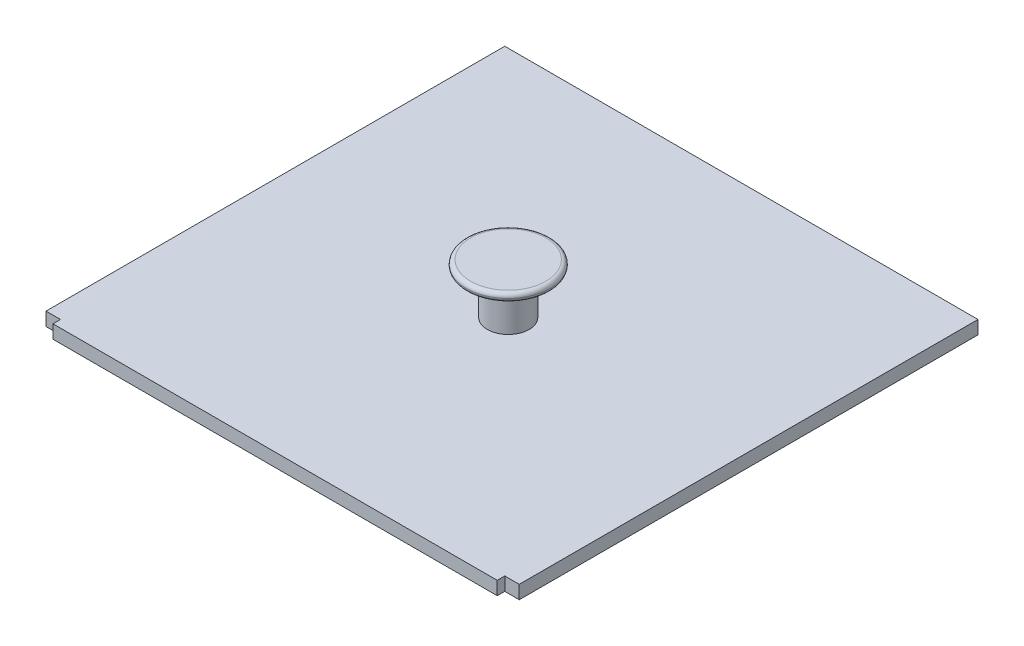
ISO-10303-21;
HEADER;
FILE_DESCRIPTION(('STEP AP214'),'2;1');
FILE_NAME('part.step','',(''),(''),'','','');
FILE_SCHEMA(('AUTOMOTIVE_DESIGN { 1 0 10303 214 1 1 1 1 }'));
ENDSEC;
DATA;
#1=APPLICATION_CONTEXT('core data for automotive mechanical design processes');
#2=APPLICATION_PROTOCOL_DEFINITION('international standard','automotive_design',2000,#1);
#3=PRODUCT_CONTEXT('',#1,'mechanical');
#4=PRODUCT('Part','Part','',(#3));
#5=PRODUCT_RELATED_PRODUCT_CATEGORY('part','',(#4));
#6=PRODUCT_DEFINITION_FORMATION('','',#4);
#7=PRODUCT_DEFINITION_CONTEXT('part definition',#1,'design');
#8=PRODUCT_DEFINITION('design','',#6,#7);
#9=PRODUCT_DEFINITION_SHAPE('','',#8);
#10=(LENGTH_UNIT() NAMED_UNIT(*) SI_UNIT(.MILLI.,.METRE.));
#11=(NAMED_UNIT(*) PLANE_ANGLE_UNIT() SI_UNIT($,.RADIAN.));
#12=(NAMED_UNIT(*) SI_UNIT($,.STERADIAN.) SOLID_ANGLE_UNIT());
#13=UNCERTAINTY_MEASURE_WITH_UNIT(LENGTH_MEASURE(1.E-05),#10,'distance_accuracy_value','');
#14=(GEOMETRIC_REPRESENTATION_CONTEXT(3) GLOBAL_UNCERTAINTY_ASSIGNED_CONTEXT((#13)) GLOBAL_UNIT_ASSIGNED_CONTEXT((#10,
#11,#12)) REPRESENTATION_CONTEXT('',''));
#15=CARTESIAN_POINT('',(0.,0.,0.));
#16=DIRECTION('',(0.,0.,1.));
#17=DIRECTION('',(1.,0.,0.));
#18=AXIS2_PLACEMENT_3D('',#15,#16,#17);
#19=CARTESIAN_POINT('',(84.9,2.4,-83.65));
#20=DIRECTION('',(-1.,0.,0.));
#21=DIRECTION('',(0.,0.,1.));
#22=AXIS2_PLACEMENT_3D('',#19,#20,#21);
#23=PLANE('',#22);
#24=DIRECTION('',(0.,0.,-1.));
#25=VECTOR('',#24,1.);
#26=CARTESIAN_POINT('',(84.9,2.4,-83.65));
#27=LINE('',#26,#25);
#28=CARTESIAN_POINT('',(84.9,2.4,80.95));
#29=VERTEX_POINT('',#28);
#30=CARTESIAN_POINT('',(84.9,2.4,-83.65));
#31=VERTEX_POINT('',#30);
#32=EDGE_CURVE('E136',#29,#31,#27,.T.);
#33=ORIENTED_EDGE('',*,*,#32,.F.);
#34=DIRECTION('',(0.,1.,0.));
#35=VECTOR('',#34,1.);
#36=CARTESIAN_POINT('',(84.9,-2.4,80.95));
#37=LINE('',#36,#35);
#38=CARTESIAN_POINT('',(84.9,-2.4,80.95));
#39=VERTEX_POINT('',#38);
#40=EDGE_CURVE('E175',#39,#29,#37,.T.);
#41=ORIENTED_EDGE('',*,*,#40,.F.);
#42=DIRECTION('',(0.,0.,-1.));
#43=VECTOR('',#42,1.);
#44=CARTESIAN_POINT('',(84.9,-2.4,-83.65));
#45=LINE('',#44,#43);
#46=CARTESIAN_POINT('',(84.9,-2.4,-83.65));
#47=VERTEX_POINT('',#46);
#48=EDGE_CURVE('E196',#39,#47,#45,.T.);
#49=ORIENTED_EDGE('',*,*,#48,.T.);
#50=DIRECTION('',(0.,-1.,0.));
#51=VECTOR('',#50,1.);
#52=CARTESIAN_POINT('',(84.9,2.4,-83.65));
#53=LINE('',#52,#51);
#54=EDGE_CURVE('E152',#31,#47,#53,.T.);
#55=ORIENTED_EDGE('',*,*,#54,.F.);
#56=EDGE_LOOP('',(#33,#41,#49,#55));
#57=FACE_BOUND('',#56,.T.);
#58=ADVANCED_FACE('F45',(#57),#23,.F.);
#59=CARTESIAN_POINT('',(-84.9,2.4,-83.65));
#60=DIRECTION('',(0.,0.,1.));
#61=DIRECTION('',(1.,0.,0.));
#62=AXIS2_PLACEMENT_3D('',#59,#60,#61);
#63=PLANE('',#62);
#64=DIRECTION('',(-1.,0.,0.));
#65=VECTOR('',#64,1.);
#66=CARTESIAN_POINT('',(-84.9,-2.4,-83.65));
#67=LINE('',#66,#65);
#68=CARTESIAN_POINT('',(-84.9,-2.4,-83.65));
#69=VERTEX_POINT('',#68);
#70=EDGE_CURVE('E144',#47,#69,#67,.T.);
#71=ORIENTED_EDGE('',*,*,#70,.T.);
#72=DIRECTION('',(0.,-1.,0.));
#73=VECTOR('',#72,1.);
#74=CARTESIAN_POINT('',(-84.9,2.4,-83.65));
#75=LINE('',#74,#73);
#76=CARTESIAN_POINT('',(-84.9,2.4,-83.65));
#77=VERTEX_POINT('',#76);
#78=EDGE_CURVE('E148',#77,#69,#75,.T.);
#79=ORIENTED_EDGE('',*,*,#78,.F.);
#80=DIRECTION('',(-1.,0.,0.));
#81=VECTOR('',#80,1.);
#82=CARTESIAN_POINT('',(-84.9,2.4,-83.65));
#83=LINE('',#82,#81);
#84=EDGE_CURVE('E141',#31,#77,#83,.T.);
#85=ORIENTED_EDGE('',*,*,#84,.F.);
#86=ORIENTED_EDGE('',*,*,#54,.T.);
#87=EDGE_LOOP('',(#71,#79,#85,#86));
#88=FACE_BOUND('',#87,.T.);
#89=ADVANCED_FACE('F215',(#88),#63,.F.);
#90=CARTESIAN_POINT('',(-84.9,2.4,-83.65));
#91=DIRECTION('',(1.,0.,0.));
#92=DIRECTION('',(0.,0.,-1.));
#93=AXIS2_PLACEMENT_3D('',#90,#91,#92);
#94=PLANE('',#93);
#95=DIRECTION('',(0.,0.,1.));
#96=VECTOR('',#95,1.);
#97=CARTESIAN_POINT('',(-84.9,-2.4,-83.65));
#98=LINE('',#97,#96);
#99=CARTESIAN_POINT('',(-84.9,-2.4,80.95));
#100=VERTEX_POINT('',#99);
#101=EDGE_CURVE('E137',#69,#100,#98,.T.);
#102=ORIENTED_EDGE('',*,*,#101,.T.);
#103=DIRECTION('',(0.,1.,0.));
#104=VECTOR('',#103,1.);
#105=CARTESIAN_POINT('',(-84.9,-2.4,80.95));
#106=LINE('',#105,#104);
#107=CARTESIAN_POINT('',(-84.9,2.4,80.95));
#108=VERTEX_POINT('',#107);
#109=EDGE_CURVE('E200',#100,#108,#106,.T.);
#110=ORIENTED_EDGE('',*,*,#109,.T.);
#111=DIRECTION('',(0.,0.,1.));
#112=VECTOR('',#111,1.);
#113=CARTESIAN_POINT('',(-84.9,2.4,-83.65));
#114=LINE('',#113,#112);
#115=EDGE_CURVE('E204',#77,#108,#114,.T.);
#116=ORIENTED_EDGE('',*,*,#115,.F.);
#117=ORIENTED_EDGE('',*,*,#78,.T.);
#118=EDGE_LOOP('',(#102,#110,#116,#117));
#119=FACE_BOUND('',#118,.T.);
#120=ADVANCED_FACE('F222',(#119),#94,.F.);
#121=CARTESIAN_POINT('',(-84.9,2.4,83.65));
#122=DIRECTION('',(0.,0.,-1.));
#123=DIRECTION('',(-1.,0.,0.));
#124=AXIS2_PLACEMENT_3D('',#121,#122,#123);
#125=PLANE('',#124);
#126=DIRECTION('',(1.,0.,0.));
#127=VECTOR('',#126,1.);
#128=CARTESIAN_POINT('',(-84.9,2.4,83.65));
#129=LINE('',#128,#127);
#130=CARTESIAN_POINT('',(-79.7,2.4,83.65));
#131=VERTEX_POINT('',#130);
#132=CARTESIAN_POINT('',(79.7,2.4,83.65));
#133=VERTEX_POINT('',#132);
#134=EDGE_CURVE('E130',#131,#133,#129,.T.);
#135=ORIENTED_EDGE('',*,*,#134,.F.);
#136=DIRECTION('',(0.,1.,0.));
#137=VECTOR('',#136,1.);
#138=CARTESIAN_POINT('',(-79.7,-2.4,83.65));
#139=LINE('',#138,#137);
#140=CARTESIAN_POINT('',(-79.7,-2.4,83.65));
#141=VERTEX_POINT('',#140);
#142=EDGE_CURVE('E115',#141,#131,#139,.T.);
#143=ORIENTED_EDGE('',*,*,#142,.F.);
#144=DIRECTION('',(1.,0.,0.));
#145=VECTOR('',#144,1.);
#146=CARTESIAN_POINT('',(-84.9,-2.4,83.65));
#147=LINE('',#146,#145);
#148=CARTESIAN_POINT('',(79.7,-2.4,83.65));
#149=VERTEX_POINT('',#148);
#150=EDGE_CURVE('E128',#141,#149,#147,.T.);
#151=ORIENTED_EDGE('',*,*,#150,.T.);
#152=DIRECTION('',(0.,1.,0.));
#153=VECTOR('',#152,1.);
#154=CARTESIAN_POINT('',(79.7,-2.4,83.65));
#155=LINE('',#154,#153);
#156=EDGE_CURVE('E170',#149,#133,#155,.T.);
#157=ORIENTED_EDGE('',*,*,#156,.T.);
#158=EDGE_LOOP('',(#135,#143,#151,#157));
#159=FACE_BOUND('',#158,.T.);
#160=ADVANCED_FACE('F126',(#159),#125,.F.);
#161=CARTESIAN_POINT('',(0.,2.4,0.));
#162=DIRECTION('',(0.,1.,0.));
#163=DIRECTION('',(0.,0.,1.));
#164=AXIS2_PLACEMENT_3D('',#161,#162,#163);
#165=PLANE('',#164);
#166=DIRECTION('',(-1.,0.,0.));
#167=VECTOR('',#166,1.);
#168=CARTESIAN_POINT('',(-84.9,2.4,80.95));
#169=LINE('',#168,#167);
#170=CARTESIAN_POINT('',(-79.7,2.4,80.95));
#171=VERTEX_POINT('',#170);
#172=EDGE_CURVE('E121',#171,#108,#169,.T.);
#173=ORIENTED_EDGE('',*,*,#172,.F.);
#174=DIRECTION('',(0.,0.,-1.));
#175=VECTOR('',#174,1.);
#176=CARTESIAN_POINT('',(-79.7,2.4,83.65));
#177=LINE('',#176,#175);
#178=EDGE_CURVE('E187',#131,#171,#177,.T.);
#179=ORIENTED_EDGE('',*,*,#178,.F.);
#180=ORIENTED_EDGE('',*,*,#134,.T.);
#181=DIRECTION('',(0.,0.,1.));
#182=VECTOR('',#181,1.);
#183=CARTESIAN_POINT('',(79.7,2.4,83.65));
#184=LINE('',#183,#182);
#185=CARTESIAN_POINT('',(79.7,2.4,80.95));
#186=VERTEX_POINT('',#185);
#187=EDGE_CURVE('E179',#186,#133,#184,.T.);
#188=ORIENTED_EDGE('',*,*,#187,.F.);
#189=DIRECTION('',(-1.,0.,0.));
#190=VECTOR('',#189,1.);
#191=CARTESIAN_POINT('',(84.9,2.4,80.95));
#192=LINE('',#191,#190);
#193=EDGE_CURVE('E182',#29,#186,#192,.T.);
#194=ORIENTED_EDGE('',*,*,#193,.F.);
#195=ORIENTED_EDGE('',*,*,#32,.T.);
#196=ORIENTED_EDGE('',*,*,#84,.T.);
#197=ORIENTED_EDGE('',*,*,#115,.T.);
#198=EDGE_LOOP('',(#173,#179,#180,#188,#194,#195,#196,#197));
#199=FACE_BOUND('',#198,.T.);
#200=CARTESIAN_POINT('',(0.,2.4,0.));
#201=DIRECTION('',(0.,1.,0.));
#202=DIRECTION('',(0.,0.,1.));
#203=AXIS2_PLACEMENT_3D('',#200,#201,#202);
#204=CIRCLE('',#203,7.5);
#205=CARTESIAN_POINT('',(0.,2.4,7.5));
#206=VERTEX_POINT('',#205);
#207=EDGE_CURVE('E197',#206,#206,#204,.T.);
#208=ORIENTED_EDGE('',*,*,#207,.F.);
#209=EDGE_LOOP('',(#208));
#210=FACE_BOUND('',#209,.T.);
#211=ADVANCED_FACE('F244',(#199,#210),#165,.T.);
#212=CARTESIAN_POINT('',(0.,-2.4,0.));
#213=DIRECTION('',(0.,1.,0.));
#214=DIRECTION('',(0.,0.,1.));
#215=AXIS2_PLACEMENT_3D('',#212,#213,#214);
#216=PLANE('',#215);
#217=DIRECTION('',(0.,0.,-1.));
#218=VECTOR('',#217,1.);
#219=CARTESIAN_POINT('',(-79.7,-2.4,83.65));
#220=LINE('',#219,#218);
#221=CARTESIAN_POINT('',(-79.7,-2.4,80.95));
#222=VERTEX_POINT('',#221);
#223=EDGE_CURVE('E111',#141,#222,#220,.T.);
#224=ORIENTED_EDGE('',*,*,#223,.T.);
#225=DIRECTION('',(-1.,0.,0.));
#226=VECTOR('',#225,1.);
#227=CARTESIAN_POINT('',(-84.9,-2.4,80.95));
#228=LINE('',#227,#226);
#229=EDGE_CURVE('E62',#222,#100,#228,.T.);
#230=ORIENTED_EDGE('',*,*,#229,.T.);
#231=ORIENTED_EDGE('',*,*,#101,.F.);
#232=ORIENTED_EDGE('',*,*,#70,.F.);
#233=ORIENTED_EDGE('',*,*,#48,.F.);
#234=DIRECTION('',(-1.,0.,0.));
#235=VECTOR('',#234,1.);
#236=CARTESIAN_POINT('',(84.9,-2.4,80.95));
#237=LINE('',#236,#235);
#238=CARTESIAN_POINT('',(79.7,-2.4,80.95));
#239=VERTEX_POINT('',#238);
#240=EDGE_CURVE('E183',#39,#239,#237,.T.);
#241=ORIENTED_EDGE('',*,*,#240,.T.);
#242=DIRECTION('',(0.,0.,1.));
#243=VECTOR('',#242,1.);
#244=CARTESIAN_POINT('',(79.7,-2.4,83.65));
#245=LINE('',#244,#243);
#246=EDGE_CURVE('E70',#239,#149,#245,.T.);
#247=ORIENTED_EDGE('',*,*,#246,.T.);
#248=ORIENTED_EDGE('',*,*,#150,.F.);
#249=EDGE_LOOP('',(#224,#230,#231,#232,#233,#241,#247,#248));
#250=FACE_BOUND('',#249,.T.);
#251=ADVANCED_FACE('F133',(#250),#216,.F.);
#252=CARTESIAN_POINT('',(0.,17.4,0.));
#253=DIRECTION('',(0.,-1.,0.));
#254=DIRECTION('',(0.,0.,-1.));
#255=AXIS2_PLACEMENT_3D('',#252,#253,#254);
#256=CYLINDRICAL_SURFACE('',#255,7.5);
#257=CARTESIAN_POINT('',(0.,17.4,0.));
#258=DIRECTION('',(0.,1.,0.));
#259=DIRECTION('',(0.,0.,1.));
#260=AXIS2_PLACEMENT_3D('',#257,#258,#259);
#261=CIRCLE('',#260,7.5);
#262=CARTESIAN_POINT('',(0.,17.4,7.5));
#263=VERTEX_POINT('',#262);
#264=EDGE_CURVE('E192',#263,#263,#261,.T.);
#265=ORIENTED_EDGE('',*,*,#264,.F.);
#266=EDGE_LOOP('',(#265));
#267=FACE_BOUND('',#266,.T.);
#268=ORIENTED_EDGE('',*,*,#207,.T.);
#269=EDGE_LOOP('',(#268));
#270=FACE_BOUND('',#269,.T.);
#271=ADVANCED_FACE('F260',(#267,#270),#256,.T.);
#272=CARTESIAN_POINT('',(0.,20.4,0.));
#273=DIRECTION('',(0.,1.,0.));
#274=DIRECTION('',(0.,0.,1.));
#275=AXIS2_PLACEMENT_3D('',#272,#273,#274);
#276=PLANE('',#275);
#277=CARTESIAN_POINT('',(0.,20.4,0.));
#278=DIRECTION('',(0.,1.,0.));
#279=DIRECTION('',(0.,0.,1.));
#280=AXIS2_PLACEMENT_3D('',#277,#278,#279);
#281=CIRCLE('',#280,13.5);
#282=CARTESIAN_POINT('',(0.,20.4,13.5));
#283=VERTEX_POINT('',#282);
#284=EDGE_CURVE('E11',#283,#283,#281,.T.);
#285=ORIENTED_EDGE('',*,*,#284,.T.);
#286=EDGE_LOOP('',(#285));
#287=FACE_BOUND('',#286,.T.);
#288=ADVANCED_FACE('F264',(#287),#276,.T.);
#289=CARTESIAN_POINT('',(0.,17.4,0.));
#290=DIRECTION('',(0.,1.,0.));
#291=DIRECTION('',(0.,0.,1.));
#292=AXIS2_PLACEMENT_3D('',#289,#290,#291);
#293=PLANE('',#292);
#294=CARTESIAN_POINT('',(0.,17.4,0.));
#295=DIRECTION('',(0.,1.,0.));
#296=DIRECTION('',(0.,0.,1.));
#297=AXIS2_PLACEMENT_3D('',#294,#295,#296);
#298=CIRCLE('',#297,13.5);
#299=CARTESIAN_POINT('',(0.,17.4,13.5));
#300=VERTEX_POINT('',#299);
#301=EDGE_CURVE('E55',#300,#300,#298,.F.);
#302=ORIENTED_EDGE('',*,*,#301,.T.);
#303=EDGE_LOOP('',(#302));
#304=FACE_BOUND('',#303,.T.);
#305=ORIENTED_EDGE('',*,*,#264,.T.);
#306=EDGE_LOOP('',(#305));
#307=FACE_BOUND('',#306,.T.);
#308=ADVANCED_FACE('F160',(#304,#307),#293,.F.);
#309=CARTESIAN_POINT('',(79.7,-2.4,83.65));
#310=DIRECTION('',(-1.,0.,0.));
#311=DIRECTION('',(0.,0.,1.));
#312=AXIS2_PLACEMENT_3D('',#309,#310,#311);
#313=PLANE('',#312);
#314=ORIENTED_EDGE('',*,*,#187,.T.);
#315=ORIENTED_EDGE('',*,*,#156,.F.);
#316=ORIENTED_EDGE('',*,*,#246,.F.);
#317=DIRECTION('',(0.,1.,0.));
#318=VECTOR('',#317,1.);
#319=CARTESIAN_POINT('',(79.7,-2.4,80.95));
#320=LINE('',#319,#318);
#321=EDGE_CURVE('E172',#239,#186,#320,.T.);
#322=ORIENTED_EDGE('',*,*,#321,.T.);
#323=EDGE_LOOP('',(#314,#315,#316,#322));
#324=FACE_BOUND('',#323,.T.);
#325=ADVANCED_FACE('F268',(#324),#313,.F.);
#326=CARTESIAN_POINT('',(84.9,-2.4,80.95));
#327=DIRECTION('',(0.,0.,-1.));
#328=DIRECTION('',(-1.,0.,0.));
#329=AXIS2_PLACEMENT_3D('',#326,#327,#328);
#330=PLANE('',#329);
#331=ORIENTED_EDGE('',*,*,#193,.T.);
#332=ORIENTED_EDGE('',*,*,#321,.F.);
#333=ORIENTED_EDGE('',*,*,#240,.F.);
#334=ORIENTED_EDGE('',*,*,#40,.T.);
#335=EDGE_LOOP('',(#331,#332,#333,#334));
#336=FACE_BOUND('',#335,.T.);
#337=ADVANCED_FACE('F238',(#336),#330,.F.);
#338=CARTESIAN_POINT('',(-84.9,-2.4,80.95));
#339=DIRECTION('',(0.,0.,-1.));
#340=DIRECTION('',(-1.,0.,0.));
#341=AXIS2_PLACEMENT_3D('',#338,#339,#340);
#342=PLANE('',#341);
#343=ORIENTED_EDGE('',*,*,#172,.T.);
#344=ORIENTED_EDGE('',*,*,#109,.F.);
#345=ORIENTED_EDGE('',*,*,#229,.F.);
#346=DIRECTION('',(0.,1.,0.));
#347=VECTOR('',#346,1.);
#348=CARTESIAN_POINT('',(-79.7,-2.4,80.95));
#349=LINE('',#348,#347);
#350=EDGE_CURVE('E117',#222,#171,#349,.T.);
#351=ORIENTED_EDGE('',*,*,#350,.T.);
#352=EDGE_LOOP('',(#343,#344,#345,#351));
#353=FACE_BOUND('',#352,.T.);
#354=ADVANCED_FACE('F276',(#353),#342,.F.);
#355=CARTESIAN_POINT('',(-79.7,-2.4,83.65));
#356=DIRECTION('',(1.,0.,0.));
#357=DIRECTION('',(0.,0.,-1.));
#358=AXIS2_PLACEMENT_3D('',#355,#356,#357);
#359=PLANE('',#358);
#360=ORIENTED_EDGE('',*,*,#178,.T.);
#361=ORIENTED_EDGE('',*,*,#350,.F.);
#362=ORIENTED_EDGE('',*,*,#223,.F.);
#363=ORIENTED_EDGE('',*,*,#142,.T.);
#364=EDGE_LOOP('',(#360,#361,#362,#363));
#365=FACE_BOUND('',#364,.T.);
#366=ADVANCED_FACE('F114',(#365),#359,.F.);
#367=CARTESIAN_POINT('',(0.,18.9,0.));
#368=DIRECTION('',(0.,1.,0.));
#369=DIRECTION('',(0.,0.,1.));
#370=AXIS2_PLACEMENT_3D('',#367,#368,#369);
#371=TOROIDAL_SURFACE('',#370,13.5,1.5);
#372=ORIENTED_EDGE('',*,*,#284,.F.);
#373=EDGE_LOOP('',(#372));
#374=FACE_BOUND('',#373,.T.);
#375=CARTESIAN_POINT('',(0.,18.9,0.));
#376=DIRECTION('',(0.,1.,0.));
#377=DIRECTION('',(0.,0.,1.));
#378=AXIS2_PLACEMENT_3D('',#375,#376,#377);
#379=CIRCLE('',#378,15.);
#380=CARTESIAN_POINT('',(0.,18.9,15.));
#381=VERTEX_POINT('',#380);
#382=EDGE_CURVE('E49',#381,#381,#379,.F.);
#383=ORIENTED_EDGE('',*,*,#382,.F.);
#384=EDGE_LOOP('',(#383));
#385=FACE_BOUND('',#384,.T.);
#386=ADVANCED_FACE('F47',(#374,#385),#371,.T.);
#387=CARTESIAN_POINT('',(0.,18.9,0.));
#388=DIRECTION('',(0.,1.,0.));
#389=DIRECTION('',(0.,0.,1.));
#390=AXIS2_PLACEMENT_3D('',#387,#388,#389);
#391=TOROIDAL_SURFACE('',#390,13.5,1.5);
#392=ORIENTED_EDGE('',*,*,#301,.F.);
#393=EDGE_LOOP('',(#392));
#394=FACE_BOUND('',#393,.T.);
#395=ORIENTED_EDGE('',*,*,#382,.T.);
#396=EDGE_LOOP('',(#395));
#397=FACE_BOUND('',#396,.T.);
#398=ADVANCED_FACE('F163',(#394,#397),#391,.T.);
#399=CLOSED_SHELL('',(#58,#89,#120,#160,#211,#251,#271,#288,#308,#325,#337,#354,#366,#386,#398));
#400=MANIFOLD_SOLID_BREP('B2',#399);
#401=ADVANCED_BREP_SHAPE_REPRESENTATION('',(#18,#400),#14);
#402=SHAPE_DEFINITION_REPRESENTATION(#9,#401);
ENDSEC;
END-ISO-10303-21;
